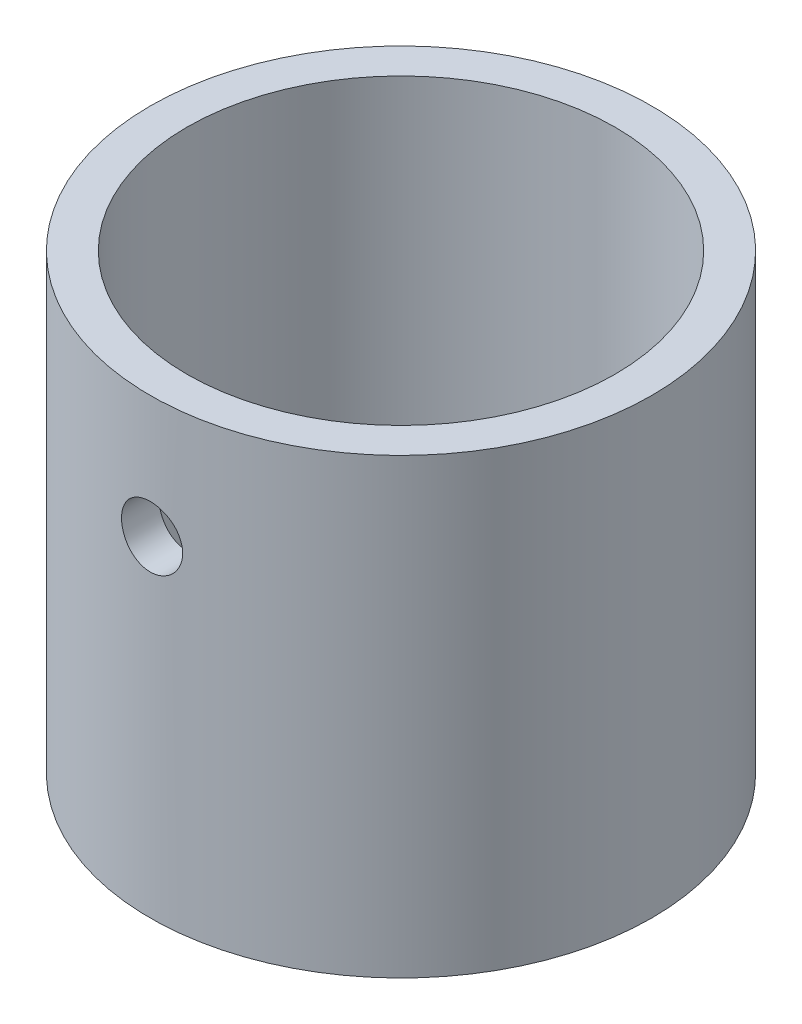
ISO-10303-21;
HEADER;
FILE_DESCRIPTION(('STEP AP214'),'2;1');
FILE_NAME('part.step','',(''),(''),'','','');
FILE_SCHEMA(('AUTOMOTIVE_DESIGN { 1 0 10303 214 1 1 1 1 }'));
ENDSEC;
DATA;
#1=APPLICATION_CONTEXT('core data for automotive mechanical design processes');
#2=APPLICATION_PROTOCOL_DEFINITION('international standard','automotive_design',2000,#1);
#3=PRODUCT_CONTEXT('',#1,'mechanical');
#4=PRODUCT('Part','Part','',(#3));
#5=PRODUCT_RELATED_PRODUCT_CATEGORY('part','',(#4));
#6=PRODUCT_DEFINITION_FORMATION('','',#4);
#7=PRODUCT_DEFINITION_CONTEXT('part definition',#1,'design');
#8=PRODUCT_DEFINITION('design','',#6,#7);
#9=PRODUCT_DEFINITION_SHAPE('','',#8);
#10=(LENGTH_UNIT() NAMED_UNIT(*) SI_UNIT(.MILLI.,.METRE.));
#11=(NAMED_UNIT(*) PLANE_ANGLE_UNIT() SI_UNIT($,.RADIAN.));
#12=(NAMED_UNIT(*) SI_UNIT($,.STERADIAN.) SOLID_ANGLE_UNIT());
#13=UNCERTAINTY_MEASURE_WITH_UNIT(LENGTH_MEASURE(1.E-05),#10,'distance_accuracy_value','');
#14=(GEOMETRIC_REPRESENTATION_CONTEXT(3) GLOBAL_UNCERTAINTY_ASSIGNED_CONTEXT((#13)) GLOBAL_UNIT_ASSIGNED_CONTEXT((#10,
#11,#12)) REPRESENTATION_CONTEXT('',''));
#15=CARTESIAN_POINT('',(0.,0.,0.));
#16=DIRECTION('',(0.,0.,1.));
#17=DIRECTION('',(1.,0.,0.));
#18=AXIS2_PLACEMENT_3D('',#15,#16,#17);
#19=CARTESIAN_POINT('',(0.,37.,0.));
#20=DIRECTION('',(0.,1.,0.));
#21=DIRECTION('',(0.,0.,1.));
#22=AXIS2_PLACEMENT_3D('',#19,#20,#21);
#23=PLANE('',#22);
#24=CARTESIAN_POINT('',(0.,37.,0.));
#25=DIRECTION('',(0.,1.,0.));
#26=DIRECTION('',(1.,0.,0.));
#27=AXIS2_PLACEMENT_3D('',#24,#25,#26);
#28=CIRCLE('',#27,20.5);
#29=CARTESIAN_POINT('',(20.5,37.,0.));
#30=VERTEX_POINT('',#29);
#31=EDGE_CURVE('E118',#30,#30,#28,.T.);
#32=ORIENTED_EDGE('',*,*,#31,.T.);
#33=EDGE_LOOP('',(#32));
#34=FACE_BOUND('',#33,.T.);
#35=CARTESIAN_POINT('',(0.,37.,0.));
#36=DIRECTION('',(0.,1.,0.));
#37=DIRECTION('',(0.,0.,1.));
#38=AXIS2_PLACEMENT_3D('',#35,#36,#37);
#39=CIRCLE('',#38,17.5);
#40=CARTESIAN_POINT('',(0.,37.,17.5));
#41=VERTEX_POINT('',#40);
#42=EDGE_CURVE('E109',#41,#41,#39,.T.);
#43=ORIENTED_EDGE('',*,*,#42,.F.);
#44=EDGE_LOOP('',(#43));
#45=FACE_BOUND('',#44,.T.);
#46=ADVANCED_FACE('F39',(#34,#45),#23,.T.);
#47=CARTESIAN_POINT('',(0.,0.,0.));
#48=DIRECTION('',(0.,1.,0.));
#49=DIRECTION('',(0.,0.,1.));
#50=AXIS2_PLACEMENT_3D('',#47,#48,#49);
#51=PLANE('',#50);
#52=CARTESIAN_POINT('',(0.,0.,0.));
#53=DIRECTION('',(0.,1.,0.));
#54=DIRECTION('',(1.,0.,0.));
#55=AXIS2_PLACEMENT_3D('',#52,#53,#54);
#56=CIRCLE('',#55,20.5);
#57=CARTESIAN_POINT('',(20.5,0.,0.));
#58=VERTEX_POINT('',#57);
#59=EDGE_CURVE('E104',#58,#58,#56,.T.);
#60=ORIENTED_EDGE('',*,*,#59,.F.);
#61=EDGE_LOOP('',(#60));
#62=FACE_BOUND('',#61,.T.);
#63=CARTESIAN_POINT('',(0.,0.,0.));
#64=DIRECTION('',(0.,1.,0.));
#65=DIRECTION('',(0.,0.,1.));
#66=AXIS2_PLACEMENT_3D('',#63,#64,#65);
#67=CIRCLE('',#66,17.5);
#68=CARTESIAN_POINT('',(0.,0.,17.5));
#69=VERTEX_POINT('',#68);
#70=EDGE_CURVE('E107',#69,#69,#67,.T.);
#71=ORIENTED_EDGE('',*,*,#70,.T.);
#72=EDGE_LOOP('',(#71));
#73=FACE_BOUND('',#72,.T.);
#74=ADVANCED_FACE('F93',(#62,#73),#51,.F.);
#75=CARTESIAN_POINT('',(0.,37.,0.));
#76=DIRECTION('',(0.,-1.,0.));
#77=DIRECTION('',(0.,0.,-1.));
#78=AXIS2_PLACEMENT_3D('',#75,#76,#77);
#79=CYLINDRICAL_SURFACE('',#78,20.5);
#80=CARTESIAN_POINT('',(-2.5,27.,20.3469899493758));
#81=CARTESIAN_POINT('',(-2.50000379849596,26.8597926070818,20.3469907990799));
#82=CARTESIAN_POINT('',(-2.48775573094334,26.7194972487949,20.3485056358115));
#83=CARTESIAN_POINT('',(-2.43990570925664,26.4428194398251,20.3542971253183));
#84=CARTESIAN_POINT('',(-2.4042573148591,26.3064453342003,20.3585792698271));
#85=CARTESIAN_POINT('',(-2.31115875098984,26.041731308995,20.3693577187336));
#86=CARTESIAN_POINT('',(-2.25374562595919,25.9133781674155,20.3758502590462));
#87=CARTESIAN_POINT('',(-2.1186352057299,25.6679939761245,20.3903402168063));
#88=CARTESIAN_POINT('',(-2.04095897255726,25.5509513420708,20.3983360692741));
#89=CARTESIAN_POINT('',(-1.9098977550477,25.3856735918949,20.4108857000797));
#90=CARTESIAN_POINT('',(-1.86333542002132,25.331891502291,20.4151999044588));
#91=CARTESIAN_POINT('',(-1.76563198838883,25.2286421321494,20.423881813368));
#92=CARTESIAN_POINT('',(-1.71449121712469,25.1791745455171,20.4282495140778));
#93=CARTESIAN_POINT('',(-1.60799499158099,25.0849532047516,20.4369078377353));
#94=CARTESIAN_POINT('',(-1.55263760485073,25.0402016346081,20.4411984242153));
#95=CARTESIAN_POINT('',(-1.43829376102881,24.9556034558948,20.4495625074168));
#96=CARTESIAN_POINT('',(-1.37930693506245,24.915757347126,20.4536359819936));
#97=CARTESIAN_POINT('',(-1.201496576402,24.8062526997392,20.4650959723489));
#98=CARTESIAN_POINT('',(-1.07827616980701,24.7435386699038,20.4720205248707));
#99=CARTESIAN_POINT('',(-0.823325996065302,24.6385275567811,20.4838570655662));
#100=CARTESIAN_POINT('',(-0.691596250619136,24.5962304214288,20.4887690588721));
#101=CARTESIAN_POINT('',(-0.487216713820331,24.5485420300832,20.4943304374079));
#102=CARTESIAN_POINT('',(-0.416377578084005,24.5351715043096,20.4958953416981));
#103=CARTESIAN_POINT('',(-0.273779035041449,24.514636400045,20.4982955132446));
#104=CARTESIAN_POINT('',(-0.202019714947378,24.5074712377769,20.4991308491361));
#105=CARTESIAN_POINT('',(-0.0581744150300558,24.4996438370767,20.5000435208179));
#106=CARTESIAN_POINT('',(0.0139113831024697,24.4989783421108,20.5001212361995));
#107=CARTESIAN_POINT('',(0.157833439219944,24.5040873670348,20.4995190514603));
#108=CARTESIAN_POINT('',(0.229669683990996,24.5098622228818,20.4988391118169));
#109=CARTESIAN_POINT('',(0.436568936467707,24.5356199625226,20.4957963784214));
#110=CARTESIAN_POINT('',(0.570692420177191,24.5636923295387,20.4924721869273));
#111=CARTESIAN_POINT('',(0.832660796062305,24.6409366112413,20.4835036996868));
#112=CARTESIAN_POINT('',(0.960500140913039,24.6901268077258,20.4778573938542));
#113=CARTESIAN_POINT('',(1.21127403163491,24.8104704945604,20.4645829013727));
#114=CARTESIAN_POINT('',(1.33384454776152,24.8823788452933,20.4568882992976));
#115=CARTESIAN_POINT('',(1.56492396635588,25.0458092130925,20.4405094308172));
#116=CARTESIAN_POINT('',(1.67344701361901,25.1373112503046,20.4318261767416));
#117=CARTESIAN_POINT('',(1.87180932181224,25.3369051851868,20.4146076605944));
#118=CARTESIAN_POINT('',(1.9618230596522,25.4448237151092,20.4060717846565));
#119=CARTESIAN_POINT('',(2.12264127702804,25.6743177466143,20.3899715419601));
#120=CARTESIAN_POINT('',(2.19342497867274,25.7959078212759,20.3824082306584));
#121=CARTESIAN_POINT('',(2.31409914015393,26.0490566346626,20.3690607773735));
#122=CARTESIAN_POINT('',(2.36399752184677,26.1806115712884,20.363275961024));
#123=CARTESIAN_POINT('',(2.44142267231951,26.4502002219553,20.3541396827085));
#124=CARTESIAN_POINT('',(2.46897050565883,26.5882277057495,20.3507859298741));
#125=CARTESIAN_POINT('',(2.49258664808368,26.7979599279999,20.3479003462962));
#126=CARTESIAN_POINT('',(2.49748280185189,26.8687506227963,20.3472989674654));
#127=CARTESIAN_POINT('',(2.50100568966376,27.0105067404535,20.3468666194515));
#128=CARTESIAN_POINT('',(2.4996328344978,27.0814721515611,20.3470355997889));
#129=CARTESIAN_POINT('',(2.4906192832822,27.2230238868525,20.3481408195335));
#130=CARTESIAN_POINT('',(2.48297583929262,27.2936100311784,20.3490773953214));
#131=CARTESIAN_POINT('',(2.46169603191761,27.4338469245017,20.3516624024854));
#132=CARTESIAN_POINT('',(2.44805909096482,27.5034975826836,20.3533109024662));
#133=CARTESIAN_POINT('',(2.39972599457406,27.7050968651735,20.3590858788744));
#134=CARTESIAN_POINT('',(2.35720920786414,27.8352200826544,20.3640952162723));
#135=CARTESIAN_POINT('',(2.25221159138439,28.0870540360355,20.375974001811));
#136=CARTESIAN_POINT('',(2.18973006982451,28.2087644802503,20.3828435144067));
#137=CARTESIAN_POINT('',(2.08007973839094,28.3857264198911,20.3942322136733));
#138=CARTESIAN_POINT('',(2.03960080142233,28.4452340729251,20.3983305648986));
#139=CARTESIAN_POINT('',(1.95363491679369,28.5605165466103,20.4067434884598));
#140=CARTESIAN_POINT('',(1.90814840481481,28.6162916913282,20.4110580419674));
#141=CARTESIAN_POINT('',(1.81236334234904,28.723500581979,20.4197855979253));
#142=CARTESIAN_POINT('',(1.76206676730392,28.774936093956,20.4241985593943));
#143=CARTESIAN_POINT('',(1.65710413693637,28.8731137135399,20.4329828207809));
#144=CARTESIAN_POINT('',(1.60243782776532,28.919855548123,20.4373541182615));
#145=CARTESIAN_POINT('',(1.43736101990696,29.0489982500146,20.4498355311894));
#146=CARTESIAN_POINT('',(1.32172414816837,29.1248806840702,20.4577057937041));
#147=CARTESIAN_POINT('',(1.07960200332915,29.2569710375679,20.4719122443993));
#148=CARTESIAN_POINT('',(0.953108111588092,29.3131631429785,20.4782471982631));
#149=CARTESIAN_POINT('',(0.688532321889539,29.4058205436044,20.4888741480476));
#150=CARTESIAN_POINT('',(0.550212603312064,29.4416193571645,20.4930966246958));
#151=CARTESIAN_POINT('',(0.269537867750538,29.4891169006174,20.4987075467394));
#152=CARTESIAN_POINT('',(0.127187273263759,29.5008410790092,20.5000989847178));
#153=CARTESIAN_POINT('',(-0.154184810285485,29.4990833855492,20.4998922459141));
#154=CARTESIAN_POINT('',(-0.293209995045902,29.4861557582131,20.4983598059995));
#155=CARTESIAN_POINT('',(-0.567200370759266,29.437415108997,20.4926110788366));
#156=CARTESIAN_POINT('',(-0.702161389931346,29.4015793582121,20.4883921261092));
#157=CARTESIAN_POINT('',(-0.964393020609303,29.3084343902766,20.4777230961902));
#158=CARTESIAN_POINT('',(-1.0916654895561,29.2511303838275,20.4712735604273));
#159=CARTESIAN_POINT('',(-1.27407878943943,29.1503187142237,20.4604610501757));
#160=CARTESIAN_POINT('',(-1.33347024839202,29.1142365720211,20.4566669474434));
#161=CARTESIAN_POINT('',(-1.44906430592348,29.0372776742545,20.4488033646641));
#162=CARTESIAN_POINT('',(-1.50526693124633,28.9964009589103,20.4447338869272));
#163=CARTESIAN_POINT('',(-1.61533122268809,28.9090377476378,20.4363359251031));
#164=CARTESIAN_POINT('',(-1.66910464245228,28.8624403862423,20.4320035728102));
#165=CARTESIAN_POINT('',(-1.77232000343861,28.7646751940839,20.4233093793217));
#166=CARTESIAN_POINT('',(-1.82176205389438,28.7135074786472,20.4189475388729));
#167=CARTESIAN_POINT('',(-1.91600179558419,28.6070030923208,20.4103204120524));
#168=CARTESIAN_POINT('',(-1.96079696360435,28.5516641843777,20.4060551791101));
#169=CARTESIAN_POINT('',(-2.04549031157649,28.4373601197328,20.3977395251897));
#170=CARTESIAN_POINT('',(-2.08538808869121,28.3783946653255,20.393689121898));
#171=CARTESIAN_POINT('',(-2.19530102754516,28.2001666584707,20.3822470925274));
#172=CARTESIAN_POINT('',(-2.25827715659926,28.0764345534142,20.3753027649307));
#173=CARTESIAN_POINT('',(-2.36337724713365,27.8204899433851,20.3633804554582));
#174=CARTESIAN_POINT('',(-2.4055226431629,27.6882863144521,20.3584004533877));
#175=CARTESIAN_POINT('',(-2.45746151234472,27.4628629263332,20.3521818272843));
#176=CARTESIAN_POINT('',(-2.47332700234867,27.3710269233642,20.3502523295481));
#177=CARTESIAN_POINT('',(-2.49459411877517,27.1861400699888,20.347656213084));
#178=CARTESIAN_POINT('',(-2.49999747802316,27.0930894233325,20.3469893852225));
#179=CARTESIAN_POINT('',(-2.5,27.,20.3469899493758));
#180=B_SPLINE_CURVE_WITH_KNOTS('',3,(#80,#81,#82,#83,#84,#85,#86,#87,#88,#89,#90,#91,#92,#93,
#94,#95,#96,#97,#98,#99,#100,#101,#102,#103,#104,#105,#106,#107,#108,#109,#110,#111,#112,#113,
#114,#115,#116,#117,#118,#119,#120,#121,#122,#123,#124,#125,#126,#127,#128,#129,#130,#131,#132,
#133,#134,#135,#136,#137,#138,#139,#140,#141,#142,#143,#144,#145,#146,#147,#148,#149,#150,#151,
#152,#153,#154,#155,#156,#157,#158,#159,#160,#161,#162,#163,#164,#165,#166,#167,#168,#169,#170,
#171,#172,#173,#174,#175,#176,#177,#178,#179),.UNSPECIFIED.,.T.,.F.,(4,2,2,2,2,2,2,2,2,2,2,2,2,
2,2,2,2,2,2,2,2,2,2,2,2,2,2,2,2,2,2,2,2,2,2,2,2,2,2,2,2,2,2,2,2,2,2,2,2,4),(0.,
0.420284495402377,0.841405619033742,1.26181317261303,1.68178547234725,1.89536255701936,
2.1089244770115,2.32258486700137,2.5362670081516,2.9496686276626,3.36306919295627,
3.57915697011867,3.79522441635197,4.01118360057496,4.22715405070779,4.6363679767822,
5.04593687779202,5.47087381524903,5.89537948685372,6.31567886110055,6.73643057524362,
7.15702255222085,7.57721767495754,7.78987357618032,8.00251554286436,8.21525074476085,
8.42800645152428,8.83710040338116,9.24620853212658,9.46224020774601,9.67825310248781,
9.89417766091856,10.1101147720672,10.5236906746597,10.9375979781342,11.3643533459781,
11.7906573721568,12.2074897062437,12.6247362548912,13.0418815964282,13.2504764072353,
13.459069468348,13.6726559464013,13.8862370364255,14.0999334985462,14.3136475266108,
14.7287074811234,15.1433394506294,15.4224297480571,15.7014738162641),.UNSPECIFIED.);
#181=CARTESIAN_POINT('',(-2.5,27.,20.3469899493758));
#182=VERTEX_POINT('',#181);
#183=EDGE_CURVE('E110',#182,#182,#180,.T.);
#184=ORIENTED_EDGE('',*,*,#183,.F.);
#185=EDGE_LOOP('',(#184));
#186=FACE_BOUND('',#185,.T.);
#187=ORIENTED_EDGE('',*,*,#31,.F.);
#188=EDGE_LOOP('',(#187));
#189=FACE_BOUND('',#188,.T.);
#190=ORIENTED_EDGE('',*,*,#59,.T.);
#191=EDGE_LOOP('',(#190));
#192=FACE_BOUND('',#191,.T.);
#193=ADVANCED_FACE('F41',(#186,#189,#192),#79,.T.);
#194=CARTESIAN_POINT('',(0.,37.,0.));
#195=DIRECTION('',(0.,-1.,0.));
#196=DIRECTION('',(0.,0.,-1.));
#197=AXIS2_PLACEMENT_3D('',#194,#195,#196);
#198=CYLINDRICAL_SURFACE('',#197,17.5);
#199=CARTESIAN_POINT('',(-2.32205158605322,27.9206672620311,17.3452609214075));
#200=CARTESIAN_POINT('',(-2.2961751744865,27.9858428414004,17.3487233238476));
#201=CARTESIAN_POINT('',(-2.26762079014225,28.0499397748589,17.3524887480895));
#202=CARTESIAN_POINT('',(-2.20533736092626,28.1755621551196,17.3605152330104));
#203=CARTESIAN_POINT('',(-2.17160660666127,28.2370867438847,17.3647764573048));
#204=CARTESIAN_POINT('',(-2.09921169761319,28.3570359509432,17.3736764591044));
#205=CARTESIAN_POINT('',(-2.06055339134434,28.4154641298247,17.3783147866995));
#206=CARTESIAN_POINT('',(-1.9784822861548,28.5288449147537,17.3878496666649));
#207=CARTESIAN_POINT('',(-1.93507022834063,28.5837980604551,17.3927461787228));
#208=CARTESIAN_POINT('',(-1.84358490020926,28.6898946107381,17.4026811848214));
#209=CARTESIAN_POINT('',(-1.79550137424746,28.7410291763842,17.4077199732023));
#210=CARTESIAN_POINT('',(-1.69506229132117,28.8388904319908,17.4177874216715));
#211=CARTESIAN_POINT('',(-1.642706260143,28.8856166314138,17.422816080572));
#212=CARTESIAN_POINT('',(-1.48001936119986,29.0187570893117,17.4376410662068));
#213=CARTESIAN_POINT('',(-1.36390115569736,29.0983272561956,17.4471954878717));
#214=CARTESIAN_POINT('',(-1.17104461730532,29.2082412470869,17.4609209496159));
#215=CARTESIAN_POINT('',(-1.09803878334675,29.2452873235749,17.465677148352));
#216=CARTESIAN_POINT('',(-0.948878308688502,29.3121694743456,17.4744163026773));
#217=CARTESIAN_POINT('',(-0.872728361626572,29.3420158710678,17.4784003636764));
#218=CARTESIAN_POINT('',(-0.795253791130822,29.3681741606212,17.4819212733524));
#219=B_SPLINE_CURVE_WITH_KNOTS('',3,(#199,#200,#201,#202,#203,#204,#205,#206,#207,#208,#209,
#210,#211,#212,#213,#214,#215,#216,#217,#218),.UNSPECIFIED.,.F.,.F.,(4,2,2,2,2,2,2,2,2,4),(0.,
0.210571309510136,0.421212306241306,0.631605581326581,0.841966102820517,1.05279935565125,
1.26365604118608,1.68460597612063,1.9302968660681,2.17563337813394),.UNSPECIFIED.);
#220=CARTESIAN_POINT('',(-2.32203674522381,27.9206528238011,17.3454217138096));
#221=VERTEX_POINT('',#220);
#222=CARTESIAN_POINT('',(-0.795245482145557,29.3681810906466,17.4816872075612));
#223=VERTEX_POINT('',#222);
#224=EDGE_CURVE('E12',#221,#223,#219,.T.);
#225=ORIENTED_EDGE('',*,*,#224,.F.);
#226=CARTESIAN_POINT('',(2.31987064781317,26.0735597911807,17.3455527492616));
#227=CARTESIAN_POINT('',(2.30478054053977,26.0357963230948,17.3475709793478));
#228=CARTESIAN_POINT('',(2.28878947827998,25.9983979535414,17.3496845302748));
#229=CARTESIAN_POINT('',(2.25502927026874,25.924388600821,17.3540851959352));
#230=CARTESIAN_POINT('',(2.23725878375401,25.8877782370221,17.3563724412258));
#231=CARTESIAN_POINT('',(2.19997148260526,25.8154303982802,17.3611022110352));
#232=CARTESIAN_POINT('',(2.18045326510315,25.779693654398,17.3635448598297));
#233=CARTESIAN_POINT('',(2.13970238005077,25.7091785309334,17.3685671700189));
#234=CARTESIAN_POINT('',(2.11846820204142,25.674401032638,17.3711469514247));
#235=CARTESIAN_POINT('',(2.07431726942178,25.6058898589938,17.3764252102733));
#236=CARTESIAN_POINT('',(2.05139882929817,25.5721572786643,17.3791238055054));
#237=CARTESIAN_POINT('',(2.00391141105991,25.5058212524461,17.3846215480052));
#238=CARTESIAN_POINT('',(1.97934048642495,25.4732192092421,17.3874208119831));
#239=CARTESIAN_POINT('',(1.92857987851985,25.4092297767992,17.3931010982772));
#240=CARTESIAN_POINT('',(1.90238788647458,25.3778442285556,17.3959822338872));
#241=CARTESIAN_POINT('',(1.84841830329509,25.3163720306524,17.4018099010093));
#242=CARTESIAN_POINT('',(1.82063793270191,25.2862878303992,17.404756541277));
#243=CARTESIAN_POINT('',(1.76355401525717,25.2275415994535,17.4106862474862));
#244=CARTESIAN_POINT('',(1.73424887351529,25.198881121775,17.4136693489657));
#245=CARTESIAN_POINT('',(1.67427354673907,25.1431291615943,17.4195769665141));
#246=CARTESIAN_POINT('',(1.6436058467503,25.1160350146468,17.422501576184));
#247=CARTESIAN_POINT('',(1.58100082211263,25.0634513181563,17.4282875931159));
#248=CARTESIAN_POINT('',(1.54906554437519,25.0379593406609,17.4311490915259));
#249=CARTESIAN_POINT('',(1.48401132086565,24.988611902361,17.4367873596982));
#250=CARTESIAN_POINT('',(1.45089391186306,24.9647544266751,17.4395642313472));
#251=CARTESIAN_POINT('',(1.38356222645562,24.9187074301621,17.4450162820977));
#252=CARTESIAN_POINT('',(1.34934912854252,24.8965161977873,17.4476915641147));
#253=CARTESIAN_POINT('',(1.27991247036745,24.8538334148007,17.4529227158917));
#254=CARTESIAN_POINT('',(1.24468984391129,24.8333403575955,17.4554786906005));
#255=CARTESIAN_POINT('',(1.17332039910343,24.7940856672816,17.4604519904897));
#256=CARTESIAN_POINT('',(1.13717434891489,24.7753226512956,17.4628694258135));
#257=CARTESIAN_POINT('',(1.06404461808329,24.7395600446105,17.4675532170505));
#258=CARTESIAN_POINT('',(1.02706159020888,24.7225591337,17.4698196856099));
#259=CARTESIAN_POINT('',(0.952107249003909,24.6902505746155,17.4741771160467));
#260=CARTESIAN_POINT('',(0.914131571637807,24.6749529072085,17.4762670277058));
#261=CARTESIAN_POINT('',(0.837506621466697,24.6462082351098,17.4802164459128));
#262=CARTESIAN_POINT('',(0.798857870871986,24.6327598619068,17.482076122736));
#263=CARTESIAN_POINT('',(0.720974856967427,24.6077464597171,17.4855524776669));
#264=CARTESIAN_POINT('',(0.681741025857131,24.5961801090636,17.4871693262409));
#265=CARTESIAN_POINT('',(0.60277561195874,24.574963294033,17.4901398739026));
#266=CARTESIAN_POINT('',(0.563044364061216,24.5653116073266,17.4914937408672));
#267=CARTESIAN_POINT('',(0.483172050409569,24.5479566159673,17.4939223567665));
#268=CARTESIAN_POINT('',(0.443031214389132,24.5402522755106,17.4949972540949));
#269=CARTESIAN_POINT('',(0.36242732346396,24.5268244776369,17.4968428413567));
#270=CARTESIAN_POINT('',(0.321964392033805,24.5211002953199,17.4976136426288));
#271=CARTESIAN_POINT('',(0.240805103315166,24.5116648089253,17.4988583244337));
#272=CARTESIAN_POINT('',(0.200108775676426,24.5079532546549,17.4993322418738));
#273=CARTESIAN_POINT('',(0.118567028024835,24.5025762791053,17.4998702187018));
#274=CARTESIAN_POINT('',(0.0777215785520698,24.5009112868282,17.4999341921688));
#275=CARTESIAN_POINT('',(0.0202702391448298,24.500028402575,17.4999721277825));
#276=CARTESIAN_POINT('',(0.00367337663107103,24.499944487679,17.4999769819588));
#277=CARTESIAN_POINT('',(-0.0457138474288369,24.5002136048568,17.4999379797874));
#278=CARTESIAN_POINT('',(-0.0785036931232039,24.5010728692458,17.4998419738081));
#279=CARTESIAN_POINT('',(-0.133707139282286,24.5036520309344,17.4995092960586));
#280=CARTESIAN_POINT('',(-0.156138910120466,24.5050160085535,17.4993263970454));
#281=CARTESIAN_POINT('',(-0.204999573126812,24.5086693285265,17.4988319709423));
#282=CARTESIAN_POINT('',(-0.231419285252763,24.5110812422888,17.4985031880105));
#283=CARTESIAN_POINT('',(-0.288202077010671,24.5171962169086,17.4976647684173));
#284=CARTESIAN_POINT('',(-0.318549644659776,24.5210404145762,17.4971351501001));
#285=CARTESIAN_POINT('',(-0.383105151429714,24.5304349653854,17.4958427726108));
#286=CARTESIAN_POINT('',(-0.417289683345758,24.5361442401926,17.4950583737185));
#287=CARTESIAN_POINT('',(-0.474648318385735,24.5469506434969,17.493576724316));
#288=CARTESIAN_POINT('',(-0.497895109328178,24.5516730644378,17.4929299946233));
#289=CARTESIAN_POINT('',(-0.543339739743659,24.5615738346027,17.4915744390206));
#290=CARTESIAN_POINT('',(-0.565543133014432,24.5667272231214,17.4908690180884));
#291=CARTESIAN_POINT('',(-0.629229193636948,24.5824157250954,17.4887256215978));
#292=CARTESIAN_POINT('',(-0.670525726756777,24.5937038685982,17.4871881862201));
#293=CARTESIAN_POINT('',(-0.748929689321773,24.6172628035972,17.4839989980331));
#294=CARTESIAN_POINT('',(-0.78608949345013,24.6293631534599,17.4823687643671));
#295=CARTESIAN_POINT('',(-0.856295035218119,24.6540064035078,17.4790666957211));
#296=CARTESIAN_POINT('',(-0.889395176126112,24.6663970668963,17.47741365246));
#297=CARTESIAN_POINT('',(-0.960227381953696,24.6945859715867,17.4736799640092));
#298=CARTESIAN_POINT('',(-0.997867073858222,24.7106134710109,17.4715729903679));
#299=CARTESIAN_POINT('',(-1.07232995335934,24.7444369892244,17.4671801772751));
#300=CARTESIAN_POINT('',(-1.10915317861877,24.7622329262288,17.4648943460962));
#301=CARTESIAN_POINT('',(-1.18189030631733,24.7995542751435,17.460159867034));
#302=CARTESIAN_POINT('',(-1.21780443570831,24.819079249821,17.4577112603516));
#303=CARTESIAN_POINT('',(-1.28862991984326,24.859819368544,17.4526706726852));
#304=CARTESIAN_POINT('',(-1.32354170381585,24.881033773992,17.450078754505));
#305=CARTESIAN_POINT('',(-1.3922691303282,24.9251134534962,17.4447702840141));
#306=CARTESIAN_POINT('',(-1.42608539191851,24.9479777707941,17.4420538042627));
#307=CARTESIAN_POINT('',(-1.49252863136931,24.9953178970122,17.4365144303325));
#308=CARTESIAN_POINT('',(-1.52515637314308,25.0197926413984,17.4336916069668));
#309=CARTESIAN_POINT('',(-1.58912854211943,25.0703140546009,17.4279606149955));
#310=CARTESIAN_POINT('',(-1.62047379357095,25.0963596863111,17.4250525033352));
#311=CARTESIAN_POINT('',(-1.68179057593869,25.1499834925635,17.4191612014998));
#312=CARTESIAN_POINT('',(-1.71176285508679,25.1775608138014,17.4161780536243));
#313=CARTESIAN_POINT('',(-1.75580374468231,25.2202300795689,17.411665506193));
#314=CARTESIAN_POINT('',(-1.7704180492785,25.2347638143162,17.4101455585345));
#315=CARTESIAN_POINT('',(-1.80328814776072,25.2683027085749,17.4067049155724));
#316=CARTESIAN_POINT('',(-1.82142454362812,25.287425862973,17.4047905060232));
#317=CARTESIAN_POINT('',(-1.86094938341315,25.3304815122928,17.4005717448982));
#318=CARTESIAN_POINT('',(-1.88218573810009,25.3545543001871,17.3982732824541));
#319=CARTESIAN_POINT('',(-1.92741501861633,25.407898174537,17.3933129600163));
#320=CARTESIAN_POINT('',(-1.95122108637194,25.4373285458927,17.3906596827007));
#321=CARTESIAN_POINT('',(-2.00098060921196,25.501809136998,17.3850282107223));
#322=CARTESIAN_POINT('',(-2.02671039903284,25.5370335799222,17.382061934934));
#323=CARTESIAN_POINT('',(-2.06512944414255,25.5926210429738,17.377557968099));
#324=CARTESIAN_POINT('',(-2.07847279802432,25.6125323298462,17.3759785582221));
#325=CARTESIAN_POINT('',(-2.10537338936919,25.6539414299591,17.3727653858373));
#326=CARTESIAN_POINT('',(-2.11889510386779,25.6754625683774,17.3711340792326));
#327=CARTESIAN_POINT('',(-2.14603515920332,25.7201411434048,17.3678291194132));
#328=CARTESIAN_POINT('',(-2.15961524414059,25.743322021907,17.3661583358164));
#329=CARTESIAN_POINT('',(-2.18674582184614,25.7913677113579,17.3627884026285));
#330=CARTESIAN_POINT('',(-2.20025527185696,25.8162559438149,17.3610925775532));
#331=CARTESIAN_POINT('',(-2.22710791187902,25.8677594054665,17.3576890516793));
#332=CARTESIAN_POINT('',(-2.24040715134477,25.8943978012528,17.3559851908342));
#333=CARTESIAN_POINT('',(-2.26669239504526,25.9494403104748,17.3525840350739));
#334=CARTESIAN_POINT('',(-2.27963144535479,25.9778671548964,17.3508911178649));
#335=CARTESIAN_POINT('',(-2.30015056554019,26.0252359550978,17.3481809940965));
#336=CARTESIAN_POINT('',(-2.30803216614094,26.0440461570041,17.3471331663203));
#337=CARTESIAN_POINT('',(-2.3233449660276,26.081857964068,17.3450862717108));
#338=CARTESIAN_POINT('',(-2.33077603015837,26.1008596246865,17.344087219527));
#339=CARTESIAN_POINT('',(-2.35238944018737,26.1581455524463,17.3411659214921));
#340=CARTESIAN_POINT('',(-2.36588536055317,26.1966954310967,17.3393204145698));
#341=CARTESIAN_POINT('',(-2.39101541989803,26.2744363377731,17.3358524014728));
#342=CARTESIAN_POINT('',(-2.40264820706565,26.313627808791,17.334230057335));
#343=CARTESIAN_POINT('',(-2.42401276102914,26.3925716117377,17.3312274766833));
#344=CARTESIAN_POINT('',(-2.43374288367042,26.4323243971939,17.3298474496679));
#345=CARTESIAN_POINT('',(-2.45126191130389,26.512308104799,17.3273487030869));
#346=CARTESIAN_POINT('',(-2.45904874657309,26.5525394893271,17.3262302622059));
#347=CARTESIAN_POINT('',(-2.47264145215449,26.633397514986,17.3242742219837));
#348=CARTESIAN_POINT('',(-2.47844465813004,26.6740246129267,17.3234370003915));
#349=CARTESIAN_POINT('',(-2.48878638094029,26.762027998689,17.3219528617931));
#350=CARTESIAN_POINT('',(-2.49297526596912,26.8094466626581,17.3213576384307));
#351=CARTESIAN_POINT('',(-2.49858630637442,26.9045777088662,17.3206028875193));
#352=CARTESIAN_POINT('',(-2.50000116547046,26.9522905354474,17.3204445085209));
#353=CARTESIAN_POINT('',(-2.49999915339663,27.0346563856156,17.3205542511864));
#354=CARTESIAN_POINT('',(-2.4992511216334,27.0693109972098,17.3207175396817));
#355=CARTESIAN_POINT('',(-2.49627557209251,27.1384925505408,17.3212523009702));
#356=CARTESIAN_POINT('',(-2.49405072596523,27.173019609814,17.3216233976362));
#357=CARTESIAN_POINT('',(-2.4875965497086,27.2483231035786,17.3226541449815));
#358=CARTESIAN_POINT('',(-2.48307253329699,27.2890739722777,17.3233544776389));
#359=CARTESIAN_POINT('',(-2.47201774663486,27.3702404850392,17.3250169281339));
#360=CARTESIAN_POINT('',(-2.46548967919767,27.4106565057615,17.3259786931853));
#361=CARTESIAN_POINT('',(-2.45046846262193,27.4910705924026,17.3281449978196));
#362=CARTESIAN_POINT('',(-2.44197740288059,27.5310690557869,17.3293492790953));
#363=CARTESIAN_POINT('',(-2.42307156974488,27.6105644236096,17.331981158008));
#364=CARTESIAN_POINT('',(-2.41265846509712,27.6500617316075,17.3334085617636));
#365=CARTESIAN_POINT('',(-2.38994974567736,27.7284713405972,17.3364673878827));
#366=CARTESIAN_POINT('',(-2.37765553241963,27.7673840536296,17.3380986581916));
#367=CARTESIAN_POINT('',(-2.35122562173791,27.8445413139569,17.3415458984978));
#368=CARTESIAN_POINT('',(-2.33709117430827,27.8827862949949,17.3433617429397));
#369=CARTESIAN_POINT('',(-2.32205158596266,27.9206672622592,17.3452609214197));
#370=B_SPLINE_CURVE_WITH_KNOTS('',3,(#226,#227,#228,#229,#230,#231,#232,#233,#234,#235,#236,
#237,#238,#239,#240,#241,#242,#243,#244,#245,#246,#247,#248,#249,#250,#251,#252,#253,#254,#255,
#256,#257,#258,#259,#260,#261,#262,#263,#264,#265,#266,#267,#268,#269,#270,#271,#272,#273,#274,
#275,#276,#277,#278,#279,#280,#281,#282,#283,#284,#285,#286,#287,#288,#289,#290,#291,#292,#293,
#294,#295,#296,#297,#298,#299,#300,#301,#302,#303,#304,#305,#306,#307,#308,#309,#310,#311,#312,
#313,#314,#315,#316,#317,#318,#319,#320,#321,#322,#323,#324,#325,#326,#327,#328,#329,#330,#331,
#332,#333,#334,#335,#336,#337,#338,#339,#340,#341,#342,#343,#344,#345,#346,#347,#348,#349,#350,
#351,#352,#353,#354,#355,#356,#357,#358,#359,#360,#361,#362,#363,#364,#365,#366,#367,#368,#369),
.UNSPECIFIED.,.F.,.F.,(4,2,2,2,2,2,2,2,2,2,2,2,2,2,2,2,2,2,2,2,2,2,2,2,2,2,2,2,2,2,2,2,2,2,2,2,
2,2,2,2,2,2,2,2,2,2,2,2,2,2,2,2,2,2,2,2,2,2,2,2,2,2,2,2,2,2,2,2,2,2,2,4),(0.,0.122138983833518,
0.244370699714116,0.366701423393749,0.489141025709564,0.61170487241153,0.734415709485946,
0.857305526938142,0.980417390199473,1.10366072221632,1.2266878348929,1.34952377652223,
1.47220546503426,1.59475936150505,1.71720333937473,1.83954857964323,1.96180148305723,
2.08473675333087,2.20758055397339,2.33033771064018,2.45301624463531,2.57562938729373,
2.69819759587921,2.82075056433429,2.94332921806303,2.99311846451324,3.09148848557174,
3.15890284251506,3.2384826583697,3.33024564115139,3.43421350336835,3.50539560437751,
3.57380188842068,3.70225881027896,3.81956129701433,3.92567780546687,4.04852249802176,
4.17136151202742,4.29416955116791,4.41692419188128,4.53960821241475,4.66221193486812,
4.78473558154682,4.90719164191036,4.96918655668054,5.04844752979818,5.14497242931093,
5.25877230302035,5.38987093687301,5.46192521787976,5.53831933423949,5.61905899899268,
5.70415024736576,5.79359947550274,5.88741364305075,5.94867280788831,6.00995025967339,
6.13255531478572,6.25524892789879,6.37804810053146,6.50097750911022,6.62407138896072,
6.76680975783152,6.90992305809956,7.01388125103495,7.11765188773552,7.24062027675204,
7.36342354460868,7.48609669836204,7.60866384229347,7.731140108651,7.85353361184161),.UNSPECIFIED.);
#371=CARTESIAN_POINT('',(2.31985417891945,26.0735758929741,17.345730890523));
#372=VERTEX_POINT('',#371);
#373=EDGE_CURVE('E63',#372,#221,#370,.T.);
#374=ORIENTED_EDGE('',*,*,#373,.F.);
#375=CARTESIAN_POINT('',(-0.795253918753001,29.3681741175523,17.4819212675469));
#376=CARTESIAN_POINT('',(-0.75798074151425,29.3807529240928,17.4836168712083));
#377=CARTESIAN_POINT('',(-0.720411266900194,29.3924691178721,17.4852120189838));
#378=CARTESIAN_POINT('',(-0.644733292623193,29.4141505320802,17.4881860198992));
#379=CARTESIAN_POINT('',(-0.60662443079472,29.424114509246,17.4895647193871));
#380=CARTESIAN_POINT('',(-0.529941634008627,29.4422555630505,17.4920890684645));
#381=CARTESIAN_POINT('',(-0.491367331793407,29.4504311159718,17.4932345192716));
#382=CARTESIAN_POINT('',(-0.413827869174495,29.4649595990882,17.4952754372182));
#383=CARTESIAN_POINT('',(-0.374862339300622,29.4713105970255,17.4961706393101));
#384=CARTESIAN_POINT('',(-0.296615436245093,29.4821543415063,17.4976950177344));
#385=CARTESIAN_POINT('',(-0.25733371000199,29.4866445883811,17.4983238362413));
#386=CARTESIAN_POINT('',(-0.178525918652456,29.4937314017696,17.4992961423663));
#387=CARTESIAN_POINT('',(-0.138999550279843,29.4963247115669,17.4996391394178));
#388=CARTESIAN_POINT('',(-0.0824544142904064,29.4986501088341,17.4999201927187));
#389=CARTESIAN_POINT('',(-0.0654654722258956,29.4991704533987,17.4999776357954));
#390=CARTESIAN_POINT('',(-0.0314621618052994,29.4998536719392,17.5000275299441));
#391=CARTESIAN_POINT('',(-0.0144477853456045,29.5000161748755,17.5000199135971));
#392=CARTESIAN_POINT('',(0.0119672938334583,29.4999890159245,17.4999887043549));
#393=CARTESIAN_POINT('',(0.021368376187717,29.4999243921018,17.4999737847016));
#394=CARTESIAN_POINT('',(0.0454841962998044,29.4996181496713,17.4999241525916));
#395=CARTESIAN_POINT('',(0.0601979991014726,29.4992971176675,17.499883018776));
#396=CARTESIAN_POINT('',(0.0949166384128776,29.498223927435,17.4997413706613));
#397=CARTESIAN_POINT('',(0.114917942534312,29.4973581169397,17.4996248025055));
#398=CARTESIAN_POINT('',(0.160171275447406,29.494841339191,17.4992825541481));
#399=CARTESIAN_POINT('',(0.18541506325755,29.493043408064,17.4990361889277));
#400=CARTESIAN_POINT('',(0.241085284241277,29.488213055425,17.498369400811));
#401=CARTESIAN_POINT('',(0.271495902100509,29.4850014943037,17.4979234104055));
#402=CARTESIAN_POINT('',(0.337393645539044,29.4768048513658,17.4967852481045));
#403=CARTESIAN_POINT('',(0.372854434694974,29.4716097561779,17.4960639301364));
#404=CARTESIAN_POINT('',(0.428692924058984,29.4621964074259,17.4947600420664));
#405=CARTESIAN_POINT('',(0.449158699719334,29.4584823451356,17.4942461693922));
#406=CARTESIAN_POINT('',(0.488890072701776,29.4507596958874,17.4931783714948));
#407=CARTESIAN_POINT('',(0.508160949438696,29.4467777413293,17.4926280935329));
#408=CARTESIAN_POINT('',(0.562550940659615,29.4348714655559,17.4909860656486));
#409=CARTESIAN_POINT('',(0.597553507386171,29.4264173020992,17.4898238624604));
#410=CARTESIAN_POINT('',(0.662853618258677,29.4091615348138,17.4874627721077));
#411=CARTESIAN_POINT('',(0.693197728122769,29.4005321780577,17.4862861938902));
#412=CARTESIAN_POINT('',(0.749289694414877,29.3834444651278,17.4839701353396));
#413=CARTESIAN_POINT('',(0.77508322742865,29.3751330572411,17.4828487505182));
#414=CARTESIAN_POINT('',(0.836896967591291,29.3541192223491,17.4800108677613));
#415=CARTESIAN_POINT('',(0.872778498109072,29.3410126757497,17.4782387511882));
#416=CARTESIAN_POINT('',(0.930003392239741,29.3186409426878,17.4752416214423));
#417=CARTESIAN_POINT('',(0.951547520748253,29.3098766040798,17.4740734930839));
#418=CARTESIAN_POINT('',(0.998054792125396,29.2902115771628,17.4714699968106));
#419=CARTESIAN_POINT('',(1.02297146167778,29.2792021028054,17.4700231268233));
#420=CARTESIAN_POINT('',(1.07604916502606,29.2547258203122,17.4668344637303));
#421=CARTESIAN_POINT('',(1.10415230528126,29.2411350034622,17.4650804674822));
#422=CARTESIAN_POINT('',(1.16338161834317,29.211135306754,17.4612503984167));
#423=CARTESIAN_POINT('',(1.19443692829126,29.1945879734385,17.4591617575702));
#424=CARTESIAN_POINT('',(1.25929269673185,29.1582792946234,17.4546377974041));
#425=CARTESIAN_POINT('',(1.29300731878136,29.138365996454,17.4521899584156));
#426=CARTESIAN_POINT('',(1.3628368037851,29.0948996444185,17.4469279074161));
#427=CARTESIAN_POINT('',(1.39884850139042,29.071182257849,17.4441017107563));
#428=CARTESIAN_POINT('',(1.47285331366182,29.0196540927752,17.4380702169405));
#429=CARTESIAN_POINT('',(1.51072359058581,28.9916674852194,17.4348539733394));
#430=CARTESIAN_POINT('',(1.567451148598,28.9471904861267,17.4298479773841));
#431=CARTESIAN_POINT('',(1.58690741120215,28.9314537191962,17.4280955050878));
#432=CARTESIAN_POINT('',(1.626094918642,28.8987564092773,17.4244948641507));
#433=CARTESIAN_POINT('',(1.64580627918973,28.8817720878767,17.422645663094));
#434=CARTESIAN_POINT('',(1.6854208438926,28.8465185796761,17.4188551548119));
#435=CARTESIAN_POINT('',(1.70530234396085,28.8282250985242,17.4169130376675));
#436=CARTESIAN_POINT('',(1.74516962533938,28.7902940566201,17.4129336681571));
#437=CARTESIAN_POINT('',(1.76513185432368,28.7706318104192,17.4108955614284));
#438=CARTESIAN_POINT('',(1.80504927736385,28.7298959851864,17.4067586553342));
#439=CARTESIAN_POINT('',(1.82497867653754,28.7087970804781,17.4046602928377));
#440=CARTESIAN_POINT('',(1.86473711845593,28.6651467826813,17.4004161186587));
#441=CARTESIAN_POINT('',(1.88453882147988,28.6425703923049,17.3982711778856));
#442=CARTESIAN_POINT('',(1.91815563680525,28.6027803546032,17.3945787132591));
#443=CARTESIAN_POINT('',(1.93216597709514,28.5857319503751,17.3930235794302));
#444=CARTESIAN_POINT('',(1.9600440268387,28.5508602183291,17.3898984487642));
#445=CARTESIAN_POINT('',(1.97390075692025,28.5330280914932,17.3883289535084));
#446=CARTESIAN_POINT('',(2.01566677595789,28.4777330493156,17.3835512940477));
#447=CARTESIAN_POINT('',(2.04277252275918,28.439651751204,17.3803839360888));
#448=CARTESIAN_POINT('',(2.07572804377801,28.3905060407801,17.3764613067624));
#449=CARTESIAN_POINT('',(2.08258666309056,28.3801116386633,17.3756407480573));
#450=CARTESIAN_POINT('',(2.09610371643521,28.3592922674319,17.3740162675439));
#451=CARTESIAN_POINT('',(2.10276319080853,28.3488679807637,17.3732122707414));
#452=CARTESIAN_POINT('',(2.13203033160226,28.302305578339,17.3696629627049));
#453=CARTESIAN_POINT('',(2.15380701871283,28.2656347829585,17.3669791040942));
#454=CARTESIAN_POINT('',(2.19498996200001,28.192152380393,17.3618322586424));
#455=CARTESIAN_POINT('',(2.21444114777261,28.1553661242026,17.3593654765411));
#456=CARTESIAN_POINT('',(2.25106963413628,28.0818240490758,17.3546616626328));
#457=CARTESIAN_POINT('',(2.2682919686818,28.0450909430218,17.3524204007545));
#458=CARTESIAN_POINT('',(2.30055942967356,27.9718138777444,17.3481742098949));
#459=CARTESIAN_POINT('',(2.31564968131462,27.9352900481761,17.3461646363994));
#460=CARTESIAN_POINT('',(2.34375258267429,27.8625738385928,17.3423856854854));
#461=CARTESIAN_POINT('',(2.35681033467188,27.8263991454759,17.3406112869363));
#462=CARTESIAN_POINT('',(2.38094982649967,27.7545085103423,17.337304523508));
#463=CARTESIAN_POINT('',(2.39207652906437,27.7188079232613,17.3357667875255));
#464=CARTESIAN_POINT('',(2.41075654715248,27.6538892388471,17.3331684077251));
#465=CARTESIAN_POINT('',(2.41858491091855,27.6247514156683,17.3320729895651));
#466=CARTESIAN_POINT('',(2.43302027637127,27.5669292923477,17.3300476584479));
#467=CARTESIAN_POINT('',(2.4396525289464,27.5382514017162,17.3291143446016));
#468=CARTESIAN_POINT('',(2.45542841675781,27.4641480910238,17.3268824620268));
#469=CARTESIAN_POINT('',(2.46382817814206,27.4185590248352,17.3256817746493));
#470=CARTESIAN_POINT('',(2.47806176484294,27.3270098254069,17.3236245440082));
#471=CARTESIAN_POINT('',(2.4838975174735,27.2810499974175,17.3227677422948));
#472=CARTESIAN_POINT('',(2.49228636894923,27.1956351272199,17.3215277007044));
#473=CARTESIAN_POINT('',(2.49519558501382,27.1562155632708,17.3210934082818));
#474=CARTESIAN_POINT('',(2.49906335731221,27.0772884464715,17.3205157700484));
#475=CARTESIAN_POINT('',(2.5000224483694,27.0377809207212,17.3203723444672));
#476=CARTESIAN_POINT('',(2.49997635915675,26.9587817992111,17.3203917922932));
#477=CARTESIAN_POINT('',(2.4989718839305,26.9192902028241,17.3205545557586));
#478=CARTESIAN_POINT('',(2.49504786760608,26.840420328489,17.3211674889077));
#479=CARTESIAN_POINT('',(2.49212906214556,26.8010420128455,17.3216175481878));
#480=CARTESIAN_POINT('',(2.48440095420631,26.7224773755024,17.3227887026534));
#481=CARTESIAN_POINT('',(2.47959173391459,26.6832910455311,17.3235097860559));
#482=CARTESIAN_POINT('',(2.46811416740032,26.6051890646051,17.3252059215355));
#483=CARTESIAN_POINT('',(2.46144542899462,26.5662734725271,17.3261810271845));
#484=CARTESIAN_POINT('',(2.4462781407876,26.4887916120566,17.3283683688326));
#485=CARTESIAN_POINT('',(2.4377788723676,26.4502254870697,17.3295806979424));
#486=CARTESIAN_POINT('',(2.41898019497017,26.3735211819442,17.3322256209543));
#487=CARTESIAN_POINT('',(2.40867985710838,26.3353832334875,17.3336583284684));
#488=CARTESIAN_POINT('',(2.3863084676944,26.2596139745194,17.3367271699805));
#489=CARTESIAN_POINT('',(2.37423636232781,26.2219829801794,17.3383634249559));
#490=CARTESIAN_POINT('',(2.34835080007656,26.1473060686173,17.3418225489729));
#491=CARTESIAN_POINT('',(2.33453622097335,26.1102605459195,17.343645538135));
#492=CARTESIAN_POINT('',(2.31987064781317,26.0735597911807,17.3455527492616));
#493=B_SPLINE_CURVE_WITH_KNOTS('',3,(#375,#376,#377,#378,#379,#380,#381,#382,#383,#384,#385,
#386,#387,#388,#389,#390,#391,#392,#393,#394,#395,#396,#397,#398,#399,#400,#401,#402,#403,#404,
#405,#406,#407,#408,#409,#410,#411,#412,#413,#414,#415,#416,#417,#418,#419,#420,#421,#422,#423,
#424,#425,#426,#427,#428,#429,#430,#431,#432,#433,#434,#435,#436,#437,#438,#439,#440,#441,#442,
#443,#444,#445,#446,#447,#448,#449,#450,#451,#452,#453,#454,#455,#456,#457,#458,#459,#460,#461,
#462,#463,#464,#465,#466,#467,#468,#469,#470,#471,#472,#473,#474,#475,#476,#477,#478,#479,#480,
#481,#482,#483,#484,#485,#486,#487,#488,#489,#490,#491,#492),.UNSPECIFIED.,.F.,.F.,(4,2,2,2,2,2,
2,2,2,2,2,2,2,2,2,2,2,2,2,2,2,2,2,2,2,2,2,2,2,2,2,2,2,2,2,2,2,2,2,2,2,2,2,2,2,2,2,2,2,2,2,2,2,2,
2,2,2,2,4),(0.,0.118115242770357,0.236313957499452,0.354612987339426,0.473036841370334,
0.591619270191547,0.710404809958805,0.761392954882961,0.812433943672682,0.840637414424594,
0.884786938775164,0.944841903204696,1.0207561428233,1.11248417830078,1.21998650591998,
1.28239980350693,1.34145195406156,1.44949864440301,1.54418413670382,1.62553995400475,
1.74021975283384,1.81007626077911,1.8918985934033,1.9856760528655,2.09139762956245,
2.20905318994736,2.33863630259744,2.48015012672204,2.55539588626961,2.63363696353968,
2.7148828116932,2.79914620142589,2.88642379315966,2.97672170327962,3.04307777732913,
3.11098411394478,3.25144217319252,3.28888247380201,3.32606949982278,3.45420968798443,
3.57921775950282,3.70106747008074,3.81973384307587,3.93519548900441,4.04743609935556,
4.13798994371863,4.22632235446265,4.36536171403018,4.50429638094558,4.6228367212635,
4.74134454740761,4.85980982961716,4.97822961471204,5.09664425199868,5.21508388253235,
5.33357009442532,5.45211759566809,5.57073589467724,5.68943098217686),.UNSPECIFIED.);
#494=EDGE_CURVE('E54',#223,#372,#493,.T.);
#495=ORIENTED_EDGE('',*,*,#494,.F.);
#496=EDGE_LOOP('',(#225,#374,#495));
#497=FACE_BOUND('',#496,.T.);
#498=ORIENTED_EDGE('',*,*,#42,.T.);
#499=EDGE_LOOP('',(#498));
#500=FACE_BOUND('',#499,.T.);
#501=ORIENTED_EDGE('',*,*,#70,.F.);
#502=EDGE_LOOP('',(#501));
#503=FACE_BOUND('',#502,.T.);
#504=ADVANCED_FACE('F71',(#497,#500,#503),#198,.F.);
#505=CARTESIAN_POINT('',(-2.5,27.,17.3205080756888));
#506=CARTESIAN_POINT('',(-2.5,26.3384449879886,17.3205080756888));
#507=CARTESIAN_POINT('',(-2.22822505266685,25.692590791389,17.3637380580334));
#508=CARTESIAN_POINT('',(-1.30692359181897,24.7714900832081,17.4572717501469));
#509=CARTESIAN_POINT('',(-0.654490365925568,24.5003678444761,17.4999474507973));
#510=CARTESIAN_POINT('',(0.651677183816447,24.4996329469233,17.5000524361457));
#511=CARTESIAN_POINT('',(1.30089261313357,24.765681050819,17.4578727118312));
#512=CARTESIAN_POINT('',(2.2334193430419,25.6975635156749,17.3632220296676));
#513=CARTESIAN_POINT('',(2.4997503222807,26.3460335065799,17.3205441135607));
#514=CARTESIAN_POINT('',(2.50024931277794,27.6520561495853,17.3204720904916));
#515=CARTESIAN_POINT('',(2.22991061772329,28.3047473671423,17.3635169033382));
#516=CARTESIAN_POINT('',(1.30897512762548,29.2274315186685,17.457113298905));
#517=CARTESIAN_POINT('',(0.663224575786398,29.4994279351569,17.4999182764808));
#518=CARTESIAN_POINT('',(-0.658904789712181,29.5005701987875,17.5000814569398));
#519=CARTESIAN_POINT('',(-1.30558155276837,29.2292436882223,17.4573767744989));
#520=CARTESIAN_POINT('',(-2.22723473383669,28.3090057497198,17.3638697437563));
#521=CARTESIAN_POINT('',(-2.5,27.6615550120114,17.3205080756888));
#522=CARTESIAN_POINT('',(-2.5,27.,17.3205080756888));
#523=B_SPLINE_CURVE_WITH_KNOTS('',3,(#505,#506,#507,#508,#509,#510,#511,#512,#513,#514,#515,
#516,#517,#518,#519,#520,#521,#522),.UNSPECIFIED.,.T.,.F.,(4,2,2,2,2,2,2,2,4),(0.,0.125,0.25,
0.375,0.5,0.625,0.75,0.875,1.),.UNSPECIFIED.);
#524=DIRECTION('',(0.,0.,1.));
#525=VECTOR('',#524,1.);
#526=SURFACE_OF_LINEAR_EXTRUSION('',#523,#525);
#527=ORIENTED_EDGE('',*,*,#494,.T.);
#528=ORIENTED_EDGE('',*,*,#373,.T.);
#529=ORIENTED_EDGE('',*,*,#224,.T.);
#530=EDGE_LOOP('',(#527,#528,#529));
#531=FACE_BOUND('',#530,.T.);
#532=ORIENTED_EDGE('',*,*,#183,.T.);
#533=EDGE_LOOP('',(#532));
#534=FACE_BOUND('',#533,.T.);
#535=ADVANCED_FACE('F67',(#531,#534),#526,.F.);
#536=CLOSED_SHELL('',(#46,#74,#193,#504,#535));
#537=MANIFOLD_SOLID_BREP('B2',#536);
#538=ADVANCED_BREP_SHAPE_REPRESENTATION('',(#18,#537),#14);
#539=SHAPE_DEFINITION_REPRESENTATION(#9,#538);
ENDSEC;
END-ISO-10303-21;
